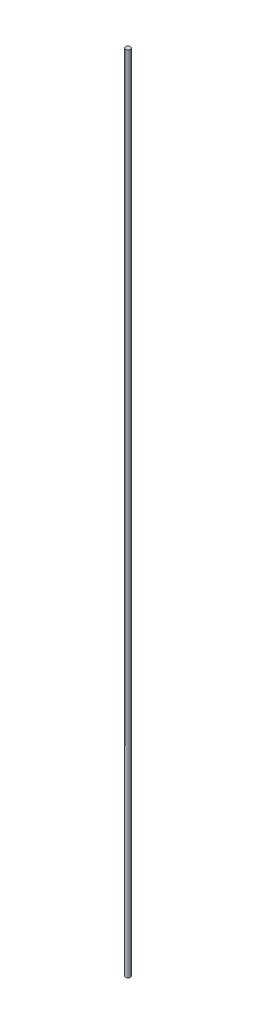
ISO-10303-21;
HEADER;
FILE_DESCRIPTION(('STEP AP214'),'2;1');
FILE_NAME('part.step','',(''),(''),'','','');
FILE_SCHEMA(('AUTOMOTIVE_DESIGN { 1 0 10303 214 1 1 1 1 }'));
ENDSEC;
DATA;
#1=APPLICATION_CONTEXT('core data for automotive mechanical design processes');
#2=APPLICATION_PROTOCOL_DEFINITION('international standard','automotive_design',2000,#1);
#3=PRODUCT_CONTEXT('',#1,'mechanical');
#4=PRODUCT('Part','Part','',(#3));
#5=PRODUCT_RELATED_PRODUCT_CATEGORY('part','',(#4));
#6=PRODUCT_DEFINITION_FORMATION('','',#4);
#7=PRODUCT_DEFINITION_CONTEXT('part definition',#1,'design');
#8=PRODUCT_DEFINITION('design','',#6,#7);
#9=PRODUCT_DEFINITION_SHAPE('','',#8);
#10=(LENGTH_UNIT() NAMED_UNIT(*) SI_UNIT(.MILLI.,.METRE.));
#11=(NAMED_UNIT(*) PLANE_ANGLE_UNIT() SI_UNIT($,.RADIAN.));
#12=(NAMED_UNIT(*) SI_UNIT($,.STERADIAN.) SOLID_ANGLE_UNIT());
#13=UNCERTAINTY_MEASURE_WITH_UNIT(LENGTH_MEASURE(1.E-05),#10,'distance_accuracy_value','');
#14=(GEOMETRIC_REPRESENTATION_CONTEXT(3) GLOBAL_UNCERTAINTY_ASSIGNED_CONTEXT((#13)) GLOBAL_UNIT_ASSIGNED_CONTEXT((#10,
#11,#12)) REPRESENTATION_CONTEXT('',''));
#15=CARTESIAN_POINT('',(0.,0.,0.));
#16=DIRECTION('',(0.,0.,1.));
#17=DIRECTION('',(1.,0.,0.));
#18=AXIS2_PLACEMENT_3D('',#15,#16,#17);
#19=CARTESIAN_POINT('',(0.,1000.,0.));
#20=DIRECTION('',(0.,-1.,0.));
#21=DIRECTION('',(0.,0.,-1.));
#22=AXIS2_PLACEMENT_3D('',#19,#20,#21);
#23=CYLINDRICAL_SURFACE('',#22,3.);
#24=CARTESIAN_POINT('',(0.,1000.,0.));
#25=DIRECTION('',(0.,1.,0.));
#26=DIRECTION('',(0.,0.,1.));
#27=AXIS2_PLACEMENT_3D('',#24,#25,#26);
#28=CIRCLE('',#27,3.);
#29=CARTESIAN_POINT('',(0.,1000.,3.));
#30=VERTEX_POINT('',#29);
#31=EDGE_CURVE('E10',#30,#30,#28,.T.);
#32=ORIENTED_EDGE('',*,*,#31,.F.);
#33=EDGE_LOOP('',(#32));
#34=FACE_BOUND('',#33,.T.);
#35=CARTESIAN_POINT('',(0.,0.,0.));
#36=DIRECTION('',(0.,1.,0.));
#37=DIRECTION('',(0.,0.,1.));
#38=AXIS2_PLACEMENT_3D('',#35,#36,#37);
#39=CIRCLE('',#38,3.);
#40=CARTESIAN_POINT('',(0.,0.,3.));
#41=VERTEX_POINT('',#40);
#42=EDGE_CURVE('E36',#41,#41,#39,.T.);
#43=ORIENTED_EDGE('',*,*,#42,.T.);
#44=EDGE_LOOP('',(#43));
#45=FACE_BOUND('',#44,.T.);
#46=ADVANCED_FACE('F33',(#34,#45),#23,.T.);
#47=CARTESIAN_POINT('',(0.,1000.,0.));
#48=DIRECTION('',(0.,1.,0.));
#49=DIRECTION('',(0.,0.,1.));
#50=AXIS2_PLACEMENT_3D('',#47,#48,#49);
#51=PLANE('',#50);
#52=ORIENTED_EDGE('',*,*,#31,.T.);
#53=EDGE_LOOP('',(#52));
#54=FACE_BOUND('',#53,.T.);
#55=ADVANCED_FACE('F48',(#54),#51,.T.);
#56=CARTESIAN_POINT('',(0.,0.,0.));
#57=DIRECTION('',(0.,1.,0.));
#58=DIRECTION('',(0.,0.,1.));
#59=AXIS2_PLACEMENT_3D('',#56,#57,#58);
#60=PLANE('',#59);
#61=ORIENTED_EDGE('',*,*,#42,.F.);
#62=EDGE_LOOP('',(#61));
#63=FACE_BOUND('',#62,.T.);
#64=ADVANCED_FACE('F46',(#63),#60,.F.);
#65=CLOSED_SHELL('',(#46,#55,#64));
#66=MANIFOLD_SOLID_BREP('B2',#65);
#67=ADVANCED_BREP_SHAPE_REPRESENTATION('',(#18,#66),#14);
#68=SHAPE_DEFINITION_REPRESENTATION(#9,#67);
ENDSEC;
END-ISO-10303-21;
